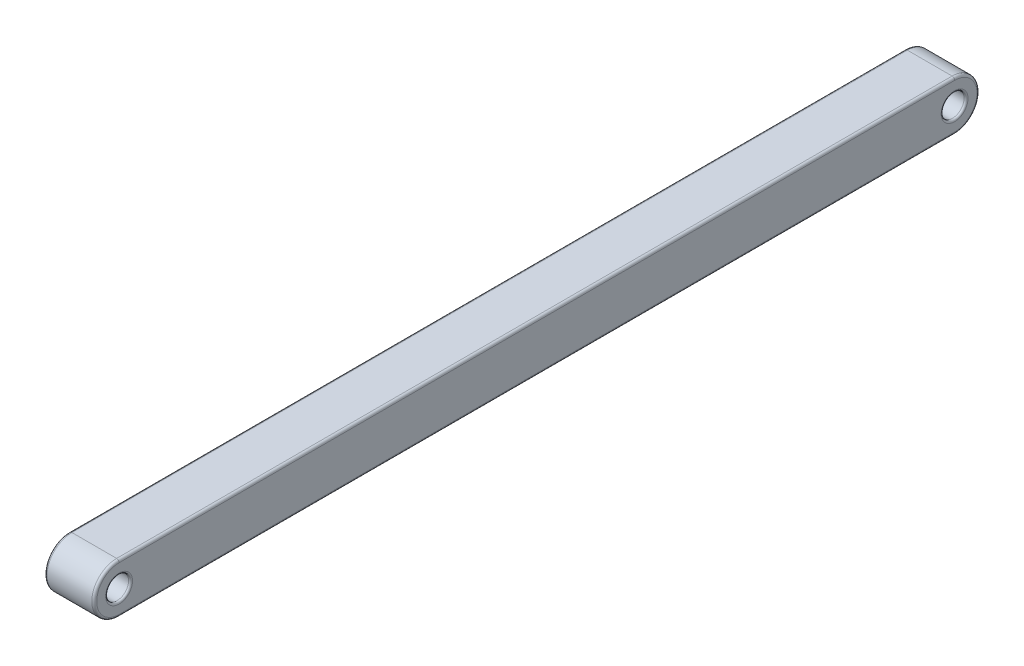
ISO-10303-21;
HEADER;
FILE_DESCRIPTION(('STEP AP214'),'2;1');
FILE_NAME('part.step','',(''),(''),'','','');
FILE_SCHEMA(('AUTOMOTIVE_DESIGN { 1 0 10303 214 1 1 1 1 }'));
ENDSEC;
DATA;
#1=APPLICATION_CONTEXT('core data for automotive mechanical design processes');
#2=APPLICATION_PROTOCOL_DEFINITION('international standard','automotive_design',2000,#1);
#3=PRODUCT_CONTEXT('',#1,'mechanical');
#4=PRODUCT('Part','Part','',(#3));
#5=PRODUCT_RELATED_PRODUCT_CATEGORY('part','',(#4));
#6=PRODUCT_DEFINITION_FORMATION('','',#4);
#7=PRODUCT_DEFINITION_CONTEXT('part definition',#1,'design');
#8=PRODUCT_DEFINITION('design','',#6,#7);
#9=PRODUCT_DEFINITION_SHAPE('','',#8);
#10=(LENGTH_UNIT() NAMED_UNIT(*) SI_UNIT(.MILLI.,.METRE.));
#11=(NAMED_UNIT(*) PLANE_ANGLE_UNIT() SI_UNIT($,.RADIAN.));
#12=(NAMED_UNIT(*) SI_UNIT($,.STERADIAN.) SOLID_ANGLE_UNIT());
#13=UNCERTAINTY_MEASURE_WITH_UNIT(LENGTH_MEASURE(1.E-05),#10,'distance_accuracy_value','');
#14=(GEOMETRIC_REPRESENTATION_CONTEXT(3) GLOBAL_UNCERTAINTY_ASSIGNED_CONTEXT((#13)) GLOBAL_UNIT_ASSIGNED_CONTEXT((#10,
#11,#12)) REPRESENTATION_CONTEXT('',''));
#15=CARTESIAN_POINT('',(0.,0.,0.));
#16=DIRECTION('',(0.,0.,1.));
#17=DIRECTION('',(1.,0.,0.));
#18=AXIS2_PLACEMENT_3D('',#15,#16,#17);
#19=CARTESIAN_POINT('',(2.5,-1.25,-41.));
#20=DIRECTION('',(-1.,0.,0.));
#21=DIRECTION('',(0.,0.,1.));
#22=AXIS2_PLACEMENT_3D('',#19,#20,#21);
#23=CYLINDRICAL_SURFACE('',#22,1.25);
#24=DIRECTION('',(-1.,0.,0.));
#25=VECTOR('',#24,1.);
#26=CARTESIAN_POINT('',(2.5,0.,-41.));
#27=LINE('',#26,#25);
#28=CARTESIAN_POINT('',(2.375,0.,-41.));
#29=VERTEX_POINT('',#28);
#30=CARTESIAN_POINT('',(0.125,0.,-41.));
#31=VERTEX_POINT('',#30);
#32=EDGE_CURVE('E113',#29,#31,#27,.T.);
#33=ORIENTED_EDGE('',*,*,#32,.F.);
#34=CARTESIAN_POINT('',(2.375,-1.25,-41.));
#35=DIRECTION('',(1.,0.,0.));
#36=DIRECTION('',(0.,0.,-1.));
#37=AXIS2_PLACEMENT_3D('',#34,#35,#36);
#38=CIRCLE('',#37,1.25);
#39=CARTESIAN_POINT('',(2.375,-2.49999999999999,-41.));
#40=VERTEX_POINT('',#39);
#41=EDGE_CURVE('E128',#29,#40,#38,.F.);
#42=ORIENTED_EDGE('',*,*,#41,.T.);
#43=DIRECTION('',(-1.,0.,0.));
#44=VECTOR('',#43,1.);
#45=CARTESIAN_POINT('',(2.5,-2.49999999999999,-41.));
#46=LINE('',#45,#44);
#47=CARTESIAN_POINT('',(0.125,-2.49999999999999,-41.));
#48=VERTEX_POINT('',#47);
#49=EDGE_CURVE('E177',#40,#48,#46,.T.);
#50=ORIENTED_EDGE('',*,*,#49,.T.);
#51=CARTESIAN_POINT('',(0.125,-1.25,-41.));
#52=DIRECTION('',(1.,0.,0.));
#53=DIRECTION('',(0.,0.,-1.));
#54=AXIS2_PLACEMENT_3D('',#51,#52,#53);
#55=CIRCLE('',#54,1.25);
#56=EDGE_CURVE('E131',#48,#31,#55,.T.);
#57=ORIENTED_EDGE('',*,*,#56,.T.);
#58=EDGE_LOOP('',(#33,#42,#50,#57));
#59=FACE_BOUND('',#58,.T.);
#60=ADVANCED_FACE('F44',(#59),#23,.T.);
#61=CARTESIAN_POINT('',(2.5,0.,0.));
#62=DIRECTION('',(0.,1.,0.));
#63=DIRECTION('',(0.,0.,1.));
#64=AXIS2_PLACEMENT_3D('',#61,#62,#63);
#65=PLANE('',#64);
#66=DIRECTION('',(-1.,0.,0.));
#67=VECTOR('',#66,1.);
#68=CARTESIAN_POINT('',(2.5,0.,1.));
#69=LINE('',#68,#67);
#70=CARTESIAN_POINT('',(2.375,0.,1.));
#71=VERTEX_POINT('',#70);
#72=CARTESIAN_POINT('',(0.125,0.,1.));
#73=VERTEX_POINT('',#72);
#74=EDGE_CURVE('E115',#71,#73,#69,.T.);
#75=ORIENTED_EDGE('',*,*,#74,.F.);
#76=DIRECTION('',(0.,0.,-1.));
#77=VECTOR('',#76,1.);
#78=CARTESIAN_POINT('',(2.375,0.,0.));
#79=LINE('',#78,#77);
#80=EDGE_CURVE('E110',#71,#29,#79,.T.);
#81=ORIENTED_EDGE('',*,*,#80,.T.);
#82=ORIENTED_EDGE('',*,*,#32,.T.);
#83=DIRECTION('',(0.,0.,-1.));
#84=VECTOR('',#83,1.);
#85=CARTESIAN_POINT('',(0.125,0.,1.));
#86=LINE('',#85,#84);
#87=EDGE_CURVE('E121',#31,#73,#86,.F.);
#88=ORIENTED_EDGE('',*,*,#87,.T.);
#89=EDGE_LOOP('',(#75,#81,#82,#88));
#90=FACE_BOUND('',#89,.T.);
#91=ADVANCED_FACE('F112',(#90),#65,.T.);
#92=CARTESIAN_POINT('',(2.5,-1.25,0.999999999999999));
#93=DIRECTION('',(-1.,0.,0.));
#94=DIRECTION('',(0.,0.,1.));
#95=AXIS2_PLACEMENT_3D('',#92,#93,#94);
#96=CYLINDRICAL_SURFACE('',#95,1.25);
#97=DIRECTION('',(-1.,0.,0.));
#98=VECTOR('',#97,1.);
#99=CARTESIAN_POINT('',(2.5,-2.5,0.999999999999999));
#100=LINE('',#99,#98);
#101=CARTESIAN_POINT('',(2.375,-2.5,0.999999999999999));
#102=VERTEX_POINT('',#101);
#103=CARTESIAN_POINT('',(0.125,-2.5,0.999999999999999));
#104=VERTEX_POINT('',#103);
#105=EDGE_CURVE('E298',#102,#104,#100,.T.);
#106=ORIENTED_EDGE('',*,*,#105,.F.);
#107=CARTESIAN_POINT('',(2.375,-1.25,0.999999999999999));
#108=DIRECTION('',(1.,0.,0.));
#109=DIRECTION('',(0.,0.,-1.));
#110=AXIS2_PLACEMENT_3D('',#107,#108,#109);
#111=CIRCLE('',#110,1.25);
#112=EDGE_CURVE('E158',#102,#71,#111,.F.);
#113=ORIENTED_EDGE('',*,*,#112,.T.);
#114=ORIENTED_EDGE('',*,*,#74,.T.);
#115=CARTESIAN_POINT('',(0.125,-1.25,0.999999999999999));
#116=DIRECTION('',(1.,0.,0.));
#117=DIRECTION('',(0.,0.,-1.));
#118=AXIS2_PLACEMENT_3D('',#115,#116,#117);
#119=CIRCLE('',#118,1.25);
#120=EDGE_CURVE('E120',#73,#104,#119,.T.);
#121=ORIENTED_EDGE('',*,*,#120,.T.);
#122=EDGE_LOOP('',(#106,#113,#114,#121));
#123=FACE_BOUND('',#122,.T.);
#124=ADVANCED_FACE('F222',(#123),#96,.T.);
#125=CARTESIAN_POINT('',(2.5,-1.25,-41.));
#126=DIRECTION('',(-1.,0.,0.));
#127=DIRECTION('',(0.,0.,1.));
#128=AXIS2_PLACEMENT_3D('',#125,#126,#127);
#129=CYLINDRICAL_SURFACE('',#128,0.575000000000002);
#130=CARTESIAN_POINT('',(0.0999999999999998,-1.25,-41.));
#131=DIRECTION('',(1.,0.,0.));
#132=DIRECTION('',(0.,0.,-1.));
#133=AXIS2_PLACEMENT_3D('',#130,#131,#132);
#134=CIRCLE('',#133,0.575000000000002);
#135=CARTESIAN_POINT('',(0.0999999999999998,-1.25,-41.575));
#136=VERTEX_POINT('',#135);
#137=EDGE_CURVE('E195',#136,#136,#134,.F.);
#138=ORIENTED_EDGE('',*,*,#137,.T.);
#139=EDGE_LOOP('',(#138));
#140=FACE_BOUND('',#139,.T.);
#141=CARTESIAN_POINT('',(2.4,-1.25,-41.));
#142=DIRECTION('',(1.,0.,0.));
#143=DIRECTION('',(0.,0.,-1.));
#144=AXIS2_PLACEMENT_3D('',#141,#142,#143);
#145=CIRCLE('',#144,0.575000000000002);
#146=CARTESIAN_POINT('',(2.4,-1.25,-41.575));
#147=VERTEX_POINT('',#146);
#148=EDGE_CURVE('E192',#147,#147,#145,.T.);
#149=ORIENTED_EDGE('',*,*,#148,.T.);
#150=EDGE_LOOP('',(#149));
#151=FACE_BOUND('',#150,.T.);
#152=ADVANCED_FACE('F267',(#140,#151),#129,.F.);
#153=CARTESIAN_POINT('',(2.5,-2.5,0.));
#154=DIRECTION('',(0.,-1.,0.));
#155=DIRECTION('',(0.,0.,-1.));
#156=AXIS2_PLACEMENT_3D('',#153,#154,#155);
#157=PLANE('',#156);
#158=ORIENTED_EDGE('',*,*,#49,.F.);
#159=DIRECTION('',(0.,0.,1.));
#160=VECTOR('',#159,1.);
#161=CARTESIAN_POINT('',(2.375,-2.5,0.));
#162=LINE('',#161,#160);
#163=EDGE_CURVE('E168',#40,#102,#162,.T.);
#164=ORIENTED_EDGE('',*,*,#163,.T.);
#165=ORIENTED_EDGE('',*,*,#105,.T.);
#166=DIRECTION('',(0.,0.,1.));
#167=VECTOR('',#166,1.);
#168=CARTESIAN_POINT('',(0.125,-2.49999999999998,-41.));
#169=LINE('',#168,#167);
#170=EDGE_CURVE('E166',#104,#48,#169,.F.);
#171=ORIENTED_EDGE('',*,*,#170,.T.);
#172=EDGE_LOOP('',(#158,#164,#165,#171));
#173=FACE_BOUND('',#172,.T.);
#174=ADVANCED_FACE('F269',(#173),#157,.T.);
#175=CARTESIAN_POINT('',(2.5,-1.25,0.999999999999999));
#176=DIRECTION('',(-1.,0.,0.));
#177=DIRECTION('',(0.,0.,1.));
#178=AXIS2_PLACEMENT_3D('',#175,#176,#177);
#179=CYLINDRICAL_SURFACE('',#178,0.575);
#180=CARTESIAN_POINT('',(0.0999999999999998,-1.25,0.999999999999999));
#181=DIRECTION('',(1.,0.,0.));
#182=DIRECTION('',(0.,0.,-1.));
#183=AXIS2_PLACEMENT_3D('',#180,#181,#182);
#184=CIRCLE('',#183,0.575);
#185=CARTESIAN_POINT('',(0.0999999999999998,-1.25,0.424999999999999));
#186=VERTEX_POINT('',#185);
#187=EDGE_CURVE('E11',#186,#186,#184,.F.);
#188=ORIENTED_EDGE('',*,*,#187,.T.);
#189=EDGE_LOOP('',(#188));
#190=FACE_BOUND('',#189,.T.);
#191=CARTESIAN_POINT('',(2.4,-1.25,0.999999999999999));
#192=DIRECTION('',(1.,0.,0.));
#193=DIRECTION('',(0.,0.,-1.));
#194=AXIS2_PLACEMENT_3D('',#191,#192,#193);
#195=CIRCLE('',#194,0.575);
#196=CARTESIAN_POINT('',(2.4,-1.25,0.424999999999999));
#197=VERTEX_POINT('',#196);
#198=EDGE_CURVE('E52',#197,#197,#195,.T.);
#199=ORIENTED_EDGE('',*,*,#198,.T.);
#200=EDGE_LOOP('',(#199));
#201=FACE_BOUND('',#200,.T.);
#202=ADVANCED_FACE('F206',(#190,#201),#179,.F.);
#203=CARTESIAN_POINT('',(2.5,0.,0.));
#204=DIRECTION('',(1.,0.,0.));
#205=DIRECTION('',(0.,0.,-1.));
#206=AXIS2_PLACEMENT_3D('',#203,#204,#205);
#207=PLANE('',#206);
#208=CARTESIAN_POINT('',(2.5,-1.25,-41.));
#209=DIRECTION('',(1.,0.,0.));
#210=DIRECTION('',(0.,0.,-1.));
#211=AXIS2_PLACEMENT_3D('',#208,#209,#210);
#212=CIRCLE('',#211,0.675000000000002);
#213=CARTESIAN_POINT('',(2.5,-1.25,-41.675));
#214=VERTEX_POINT('',#213);
#215=EDGE_CURVE('E201',#214,#214,#212,.F.);
#216=ORIENTED_EDGE('',*,*,#215,.T.);
#217=EDGE_LOOP('',(#216));
#218=FACE_BOUND('',#217,.T.);
#219=CARTESIAN_POINT('',(2.5,-1.25,0.999999999999999));
#220=DIRECTION('',(1.,0.,0.));
#221=DIRECTION('',(0.,0.,-1.));
#222=AXIS2_PLACEMENT_3D('',#219,#220,#221);
#223=CIRCLE('',#222,0.675);
#224=CARTESIAN_POINT('',(2.5,-1.25,0.324999999999999));
#225=VERTEX_POINT('',#224);
#226=EDGE_CURVE('E198',#225,#225,#223,.F.);
#227=ORIENTED_EDGE('',*,*,#226,.T.);
#228=EDGE_LOOP('',(#227));
#229=FACE_BOUND('',#228,.T.);
#230=DIRECTION('',(0.,0.,1.));
#231=VECTOR('',#230,1.);
#232=CARTESIAN_POINT('',(2.5,-2.375,0.));
#233=LINE('',#232,#231);
#234=CARTESIAN_POINT('',(2.5,-2.375,0.999999999999999));
#235=VERTEX_POINT('',#234);
#236=CARTESIAN_POINT('',(2.5,-2.37499999999998,-41.));
#237=VERTEX_POINT('',#236);
#238=EDGE_CURVE('E146',#235,#237,#233,.F.);
#239=ORIENTED_EDGE('',*,*,#238,.T.);
#240=CARTESIAN_POINT('',(2.5,-1.25,-41.));
#241=DIRECTION('',(1.,0.,0.));
#242=DIRECTION('',(0.,0.,-1.));
#243=AXIS2_PLACEMENT_3D('',#240,#241,#242);
#244=CIRCLE('',#243,1.125);
#245=CARTESIAN_POINT('',(2.5,-0.125,-41.));
#246=VERTEX_POINT('',#245);
#247=EDGE_CURVE('E154',#237,#246,#244,.T.);
#248=ORIENTED_EDGE('',*,*,#247,.T.);
#249=DIRECTION('',(0.,0.,-1.));
#250=VECTOR('',#249,1.);
#251=CARTESIAN_POINT('',(2.5,-0.124999999999974,0.));
#252=LINE('',#251,#250);
#253=CARTESIAN_POINT('',(2.5,-0.125,1.));
#254=VERTEX_POINT('',#253);
#255=EDGE_CURVE('E136',#246,#254,#252,.F.);
#256=ORIENTED_EDGE('',*,*,#255,.T.);
#257=CARTESIAN_POINT('',(2.5,-1.25,0.999999999999999));
#258=DIRECTION('',(1.,0.,0.));
#259=DIRECTION('',(0.,0.,-1.));
#260=AXIS2_PLACEMENT_3D('',#257,#258,#259);
#261=CIRCLE('',#260,1.125);
#262=EDGE_CURVE('E148',#254,#235,#261,.T.);
#263=ORIENTED_EDGE('',*,*,#262,.T.);
#264=EDGE_LOOP('',(#239,#248,#256,#263));
#265=FACE_BOUND('',#264,.T.);
#266=ADVANCED_FACE('F282',(#218,#229,#265),#207,.T.);
#267=CARTESIAN_POINT('',(0.,0.,0.));
#268=DIRECTION('',(1.,0.,0.));
#269=DIRECTION('',(0.,0.,-1.));
#270=AXIS2_PLACEMENT_3D('',#267,#268,#269);
#271=PLANE('',#270);
#272=CARTESIAN_POINT('',(0.,-1.25,-41.));
#273=DIRECTION('',(1.,0.,0.));
#274=DIRECTION('',(0.,0.,-1.));
#275=AXIS2_PLACEMENT_3D('',#272,#273,#274);
#276=CIRCLE('',#275,0.675000000000002);
#277=CARTESIAN_POINT('',(0.,-1.25,-41.675));
#278=VERTEX_POINT('',#277);
#279=EDGE_CURVE('E189',#278,#278,#276,.T.);
#280=ORIENTED_EDGE('',*,*,#279,.T.);
#281=EDGE_LOOP('',(#280));
#282=FACE_BOUND('',#281,.T.);
#283=CARTESIAN_POINT('',(0.,-1.25,0.999999999999999));
#284=DIRECTION('',(1.,0.,0.));
#285=DIRECTION('',(0.,0.,-1.));
#286=AXIS2_PLACEMENT_3D('',#283,#284,#285);
#287=CIRCLE('',#286,0.675);
#288=CARTESIAN_POINT('',(0.,-1.25,0.324999999999999));
#289=VERTEX_POINT('',#288);
#290=EDGE_CURVE('E170',#289,#289,#287,.T.);
#291=ORIENTED_EDGE('',*,*,#290,.T.);
#292=EDGE_LOOP('',(#291));
#293=FACE_BOUND('',#292,.T.);
#294=DIRECTION('',(0.,0.,-1.));
#295=VECTOR('',#294,1.);
#296=CARTESIAN_POINT('',(0.,-0.125,-41.));
#297=LINE('',#296,#295);
#298=CARTESIAN_POINT('',(0.,-0.125,1.));
#299=VERTEX_POINT('',#298);
#300=CARTESIAN_POINT('',(0.,-0.125,-41.));
#301=VERTEX_POINT('',#300);
#302=EDGE_CURVE('E59',#299,#301,#297,.T.);
#303=ORIENTED_EDGE('',*,*,#302,.T.);
#304=CARTESIAN_POINT('',(0.,-1.25,-41.));
#305=DIRECTION('',(1.,0.,0.));
#306=DIRECTION('',(0.,0.,-1.));
#307=AXIS2_PLACEMENT_3D('',#304,#305,#306);
#308=CIRCLE('',#307,1.125);
#309=CARTESIAN_POINT('',(0.,-2.37499999999998,-41.));
#310=VERTEX_POINT('',#309);
#311=EDGE_CURVE('E164',#301,#310,#308,.F.);
#312=ORIENTED_EDGE('',*,*,#311,.T.);
#313=DIRECTION('',(0.,0.,1.));
#314=VECTOR('',#313,1.);
#315=CARTESIAN_POINT('',(0.,-2.375,0.999999999999999));
#316=LINE('',#315,#314);
#317=CARTESIAN_POINT('',(0.,-2.375,0.999999999999999));
#318=VERTEX_POINT('',#317);
#319=EDGE_CURVE('E160',#310,#318,#316,.T.);
#320=ORIENTED_EDGE('',*,*,#319,.T.);
#321=CARTESIAN_POINT('',(0.,-1.25,0.999999999999999));
#322=DIRECTION('',(1.,0.,0.));
#323=DIRECTION('',(0.,0.,-1.));
#324=AXIS2_PLACEMENT_3D('',#321,#322,#323);
#325=CIRCLE('',#324,1.125);
#326=EDGE_CURVE('E64',#318,#299,#325,.F.);
#327=ORIENTED_EDGE('',*,*,#326,.T.);
#328=EDGE_LOOP('',(#303,#312,#320,#327));
#329=FACE_BOUND('',#328,.T.);
#330=ADVANCED_FACE('F238',(#282,#293,#329),#271,.F.);
#331=CARTESIAN_POINT('',(2.375,-1.25,0.999999999999999));
#332=DIRECTION('',(1.,0.,0.));
#333=DIRECTION('',(0.,0.,-1.));
#334=AXIS2_PLACEMENT_3D('',#331,#332,#333);
#335=TOROIDAL_SURFACE('',#334,1.125,0.125);
#336=CARTESIAN_POINT('',(2.375,-2.375,0.999999999999999));
#337=DIRECTION('',(0.,0.,-1.));
#338=DIRECTION('',(-1.,0.,0.));
#339=AXIS2_PLACEMENT_3D('',#336,#337,#338);
#340=CIRCLE('',#339,0.125);
#341=EDGE_CURVE('E140',#235,#102,#340,.T.);
#342=ORIENTED_EDGE('',*,*,#341,.F.);
#343=ORIENTED_EDGE('',*,*,#262,.F.);
#344=CARTESIAN_POINT('',(2.375,-0.125,1.));
#345=DIRECTION('',(0.,0.,-1.));
#346=DIRECTION('',(-1.,0.,0.));
#347=AXIS2_PLACEMENT_3D('',#344,#345,#346);
#348=CIRCLE('',#347,0.125);
#349=EDGE_CURVE('E175',#71,#254,#348,.T.);
#350=ORIENTED_EDGE('',*,*,#349,.F.);
#351=ORIENTED_EDGE('',*,*,#112,.F.);
#352=EDGE_LOOP('',(#342,#343,#350,#351));
#353=FACE_BOUND('',#352,.T.);
#354=ADVANCED_FACE('F235',(#353),#335,.T.);
#355=CARTESIAN_POINT('',(2.375,-0.124999999999974,0.));
#356=DIRECTION('',(0.,0.,-1.));
#357=DIRECTION('',(0.,1.,0.));
#358=AXIS2_PLACEMENT_3D('',#355,#356,#357);
#359=CYLINDRICAL_SURFACE('',#358,0.125);
#360=ORIENTED_EDGE('',*,*,#349,.T.);
#361=ORIENTED_EDGE('',*,*,#255,.F.);
#362=CARTESIAN_POINT('',(2.375,-0.125,-41.));
#363=DIRECTION('',(0.,0.,-1.));
#364=DIRECTION('',(-1.,0.,0.));
#365=AXIS2_PLACEMENT_3D('',#362,#363,#364);
#366=CIRCLE('',#365,0.125);
#367=EDGE_CURVE('E134',#29,#246,#366,.T.);
#368=ORIENTED_EDGE('',*,*,#367,.F.);
#369=ORIENTED_EDGE('',*,*,#80,.F.);
#370=EDGE_LOOP('',(#360,#361,#368,#369));
#371=FACE_BOUND('',#370,.T.);
#372=ADVANCED_FACE('F135',(#371),#359,.T.);
#373=CARTESIAN_POINT('',(2.375,-2.375,0.));
#374=DIRECTION('',(0.,0.,1.));
#375=DIRECTION('',(0.,-1.,0.));
#376=AXIS2_PLACEMENT_3D('',#373,#374,#375);
#377=CYLINDRICAL_SURFACE('',#376,0.125);
#378=ORIENTED_EDGE('',*,*,#341,.T.);
#379=ORIENTED_EDGE('',*,*,#163,.F.);
#380=CARTESIAN_POINT('',(2.375,-2.37499999999998,-41.));
#381=DIRECTION('',(0.,0.,-1.));
#382=DIRECTION('',(-1.,0.,0.));
#383=AXIS2_PLACEMENT_3D('',#380,#381,#382);
#384=CIRCLE('',#383,0.125);
#385=EDGE_CURVE('E141',#237,#40,#384,.T.);
#386=ORIENTED_EDGE('',*,*,#385,.F.);
#387=ORIENTED_EDGE('',*,*,#238,.F.);
#388=EDGE_LOOP('',(#378,#379,#386,#387));
#389=FACE_BOUND('',#388,.T.);
#390=ADVANCED_FACE('F229',(#389),#377,.T.);
#391=CARTESIAN_POINT('',(2.375,-1.25,-41.));
#392=DIRECTION('',(1.,0.,0.));
#393=DIRECTION('',(0.,0.,-1.));
#394=AXIS2_PLACEMENT_3D('',#391,#392,#393);
#395=TOROIDAL_SURFACE('',#394,1.125,0.125);
#396=ORIENTED_EDGE('',*,*,#367,.T.);
#397=ORIENTED_EDGE('',*,*,#247,.F.);
#398=ORIENTED_EDGE('',*,*,#385,.T.);
#399=ORIENTED_EDGE('',*,*,#41,.F.);
#400=EDGE_LOOP('',(#396,#397,#398,#399));
#401=FACE_BOUND('',#400,.T.);
#402=ADVANCED_FACE('F143',(#401),#395,.T.);
#403=CARTESIAN_POINT('',(0.125,-1.25,0.999999999999999));
#404=DIRECTION('',(1.,0.,0.));
#405=DIRECTION('',(0.,0.,-1.));
#406=AXIS2_PLACEMENT_3D('',#403,#404,#405);
#407=TOROIDAL_SURFACE('',#406,1.125,0.125);
#408=CARTESIAN_POINT('',(0.125,-2.375,0.999999999999999));
#409=DIRECTION('',(0.,0.,-1.));
#410=DIRECTION('',(-1.,0.,0.));
#411=AXIS2_PLACEMENT_3D('',#408,#409,#410);
#412=CIRCLE('',#411,0.125);
#413=EDGE_CURVE('E182',#104,#318,#412,.T.);
#414=ORIENTED_EDGE('',*,*,#413,.F.);
#415=ORIENTED_EDGE('',*,*,#120,.F.);
#416=CARTESIAN_POINT('',(0.125,-0.125,1.));
#417=DIRECTION('',(0.,0.,-1.));
#418=DIRECTION('',(-1.,0.,0.));
#419=AXIS2_PLACEMENT_3D('',#416,#417,#418);
#420=CIRCLE('',#419,0.125);
#421=EDGE_CURVE('E171',#299,#73,#420,.T.);
#422=ORIENTED_EDGE('',*,*,#421,.F.);
#423=ORIENTED_EDGE('',*,*,#326,.F.);
#424=EDGE_LOOP('',(#414,#415,#422,#423));
#425=FACE_BOUND('',#424,.T.);
#426=ADVANCED_FACE('F228',(#425),#407,.T.);
#427=CARTESIAN_POINT('',(0.125,-0.124999999999974,0.));
#428=DIRECTION('',(0.,0.,1.));
#429=DIRECTION('',(0.,-1.,0.));
#430=AXIS2_PLACEMENT_3D('',#427,#428,#429);
#431=CYLINDRICAL_SURFACE('',#430,0.125);
#432=ORIENTED_EDGE('',*,*,#421,.T.);
#433=ORIENTED_EDGE('',*,*,#87,.F.);
#434=CARTESIAN_POINT('',(0.125,-0.125,-41.));
#435=DIRECTION('',(0.,0.,-1.));
#436=DIRECTION('',(-1.,0.,0.));
#437=AXIS2_PLACEMENT_3D('',#434,#435,#436);
#438=CIRCLE('',#437,0.125);
#439=EDGE_CURVE('E180',#301,#31,#438,.T.);
#440=ORIENTED_EDGE('',*,*,#439,.F.);
#441=ORIENTED_EDGE('',*,*,#302,.F.);
#442=EDGE_LOOP('',(#432,#433,#440,#441));
#443=FACE_BOUND('',#442,.T.);
#444=ADVANCED_FACE('F248',(#443),#431,.T.);
#445=CARTESIAN_POINT('',(0.125,-2.375,0.));
#446=DIRECTION('',(0.,0.,-1.));
#447=DIRECTION('',(0.,1.,0.));
#448=AXIS2_PLACEMENT_3D('',#445,#446,#447);
#449=CYLINDRICAL_SURFACE('',#448,0.125);
#450=ORIENTED_EDGE('',*,*,#413,.T.);
#451=ORIENTED_EDGE('',*,*,#319,.F.);
#452=CARTESIAN_POINT('',(0.125,-2.37499999999998,-41.));
#453=DIRECTION('',(0.,0.,-1.));
#454=DIRECTION('',(-1.,0.,0.));
#455=AXIS2_PLACEMENT_3D('',#452,#453,#454);
#456=CIRCLE('',#455,0.125);
#457=EDGE_CURVE('E178',#48,#310,#456,.T.);
#458=ORIENTED_EDGE('',*,*,#457,.F.);
#459=ORIENTED_EDGE('',*,*,#170,.F.);
#460=EDGE_LOOP('',(#450,#451,#458,#459));
#461=FACE_BOUND('',#460,.T.);
#462=ADVANCED_FACE('F244',(#461),#449,.T.);
#463=CARTESIAN_POINT('',(0.125,-1.25,-41.));
#464=DIRECTION('',(1.,0.,0.));
#465=DIRECTION('',(0.,0.,-1.));
#466=AXIS2_PLACEMENT_3D('',#463,#464,#465);
#467=TOROIDAL_SURFACE('',#466,1.125,0.125);
#468=ORIENTED_EDGE('',*,*,#439,.T.);
#469=ORIENTED_EDGE('',*,*,#56,.F.);
#470=ORIENTED_EDGE('',*,*,#457,.T.);
#471=ORIENTED_EDGE('',*,*,#311,.F.);
#472=EDGE_LOOP('',(#468,#469,#470,#471));
#473=FACE_BOUND('',#472,.T.);
#474=ADVANCED_FACE('F240',(#473),#467,.T.);
#475=CARTESIAN_POINT('',(0.0999999999999998,-1.25,-41.));
#476=DIRECTION('',(1.,0.,0.));
#477=DIRECTION('',(0.,0.,-1.));
#478=AXIS2_PLACEMENT_3D('',#475,#476,#477);
#479=TOROIDAL_SURFACE('',#478,0.675000000000002,0.1);
#480=ORIENTED_EDGE('',*,*,#137,.F.);
#481=EDGE_LOOP('',(#480));
#482=FACE_BOUND('',#481,.T.);
#483=ORIENTED_EDGE('',*,*,#279,.F.);
#484=EDGE_LOOP('',(#483));
#485=FACE_BOUND('',#484,.T.);
#486=ADVANCED_FACE('F243',(#482,#485),#479,.T.);
#487=CARTESIAN_POINT('',(2.4,-1.25,-41.));
#488=DIRECTION('',(1.,0.,0.));
#489=DIRECTION('',(0.,0.,-1.));
#490=AXIS2_PLACEMENT_3D('',#487,#488,#489);
#491=TOROIDAL_SURFACE('',#490,0.675000000000002,0.1);
#492=ORIENTED_EDGE('',*,*,#215,.F.);
#493=EDGE_LOOP('',(#492));
#494=FACE_BOUND('',#493,.T.);
#495=ORIENTED_EDGE('',*,*,#148,.F.);
#496=EDGE_LOOP('',(#495));
#497=FACE_BOUND('',#496,.T.);
#498=ADVANCED_FACE('F214',(#494,#497),#491,.T.);
#499=CARTESIAN_POINT('',(0.0999999999999998,-1.25,0.999999999999999));
#500=DIRECTION('',(1.,0.,0.));
#501=DIRECTION('',(0.,0.,-1.));
#502=AXIS2_PLACEMENT_3D('',#499,#500,#501);
#503=TOROIDAL_SURFACE('',#502,0.675,0.1);
#504=ORIENTED_EDGE('',*,*,#187,.F.);
#505=EDGE_LOOP('',(#504));
#506=FACE_BOUND('',#505,.T.);
#507=ORIENTED_EDGE('',*,*,#290,.F.);
#508=EDGE_LOOP('',(#507));
#509=FACE_BOUND('',#508,.T.);
#510=ADVANCED_FACE('F209',(#506,#509),#503,.T.);
#511=CARTESIAN_POINT('',(2.4,-1.25,0.999999999999999));
#512=DIRECTION('',(1.,0.,0.));
#513=DIRECTION('',(0.,0.,-1.));
#514=AXIS2_PLACEMENT_3D('',#511,#512,#513);
#515=TOROIDAL_SURFACE('',#514,0.675,0.1);
#516=ORIENTED_EDGE('',*,*,#226,.F.);
#517=EDGE_LOOP('',(#516));
#518=FACE_BOUND('',#517,.T.);
#519=ORIENTED_EDGE('',*,*,#198,.F.);
#520=EDGE_LOOP('',(#519));
#521=FACE_BOUND('',#520,.T.);
#522=ADVANCED_FACE('F46',(#518,#521),#515,.T.);
#523=CLOSED_SHELL('',(#60,#91,#124,#152,#174,#202,#266,#330,#354,#372,#390,#402,#426,#444,#462,
#474,#486,#498,#510,#522));
#524=MANIFOLD_SOLID_BREP('B2',#523);
#525=ADVANCED_BREP_SHAPE_REPRESENTATION('',(#18,#524),#14);
#526=SHAPE_DEFINITION_REPRESENTATION(#9,#525);
ENDSEC;
END-ISO-10303-21;
